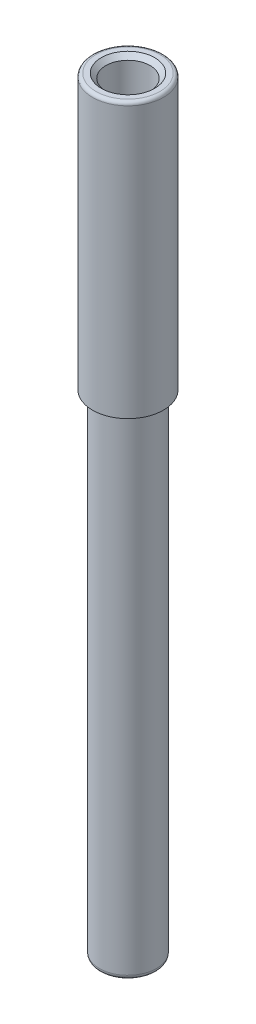
ISO-10303-21;
HEADER;
FILE_DESCRIPTION(('STEP AP214'),'2;1');
FILE_NAME('part.step','',(''),(''),'','','');
FILE_SCHEMA(('AUTOMOTIVE_DESIGN { 1 0 10303 214 1 1 1 1 }'));
ENDSEC;
DATA;
#1=APPLICATION_CONTEXT('core data for automotive mechanical design processes');
#2=APPLICATION_PROTOCOL_DEFINITION('international standard','automotive_design',2000,#1);
#3=PRODUCT_CONTEXT('',#1,'mechanical');
#4=PRODUCT('Part','Part','',(#3));
#5=PRODUCT_RELATED_PRODUCT_CATEGORY('part','',(#4));
#6=PRODUCT_DEFINITION_FORMATION('','',#4);
#7=PRODUCT_DEFINITION_CONTEXT('part definition',#1,'design');
#8=PRODUCT_DEFINITION('design','',#6,#7);
#9=PRODUCT_DEFINITION_SHAPE('','',#8);
#10=(LENGTH_UNIT() NAMED_UNIT(*) SI_UNIT(.MILLI.,.METRE.));
#11=(NAMED_UNIT(*) PLANE_ANGLE_UNIT() SI_UNIT($,.RADIAN.));
#12=(NAMED_UNIT(*) SI_UNIT($,.STERADIAN.) SOLID_ANGLE_UNIT());
#13=UNCERTAINTY_MEASURE_WITH_UNIT(LENGTH_MEASURE(1.E-05),#10,'distance_accuracy_value','');
#14=(GEOMETRIC_REPRESENTATION_CONTEXT(3) GLOBAL_UNCERTAINTY_ASSIGNED_CONTEXT((#13)) GLOBAL_UNIT_ASSIGNED_CONTEXT((#10,
#11,#12)) REPRESENTATION_CONTEXT('',''));
#15=CARTESIAN_POINT('',(0.,0.,0.));
#16=DIRECTION('',(0.,0.,1.));
#17=DIRECTION('',(1.,0.,0.));
#18=AXIS2_PLACEMENT_3D('',#15,#16,#17);
#19=CARTESIAN_POINT('',(0.,54.61,0.));
#20=DIRECTION('',(0.,1.,0.));
#21=DIRECTION('',(0.,0.,1.));
#22=AXIS2_PLACEMENT_3D('',#19,#20,#21);
#23=CYLINDRICAL_SURFACE('',#22,3.937);
#24=CARTESIAN_POINT('',(0.,84.709,0.));
#25=DIRECTION('',(0.,1.,0.));
#26=DIRECTION('',(0.,0.,1.));
#27=AXIS2_PLACEMENT_3D('',#24,#25,#26);
#28=CIRCLE('',#27,3.937);
#29=CARTESIAN_POINT('',(0.,84.709,3.937));
#30=VERTEX_POINT('',#29);
#31=EDGE_CURVE('E11',#30,#30,#28,.F.);
#32=ORIENTED_EDGE('',*,*,#31,.T.);
#33=EDGE_LOOP('',(#32));
#34=FACE_BOUND('',#33,.T.);
#35=CARTESIAN_POINT('',(0.,54.61,0.));
#36=DIRECTION('',(0.,1.,0.));
#37=DIRECTION('',(0.,0.,1.));
#38=AXIS2_PLACEMENT_3D('',#35,#36,#37);
#39=CIRCLE('',#38,3.937);
#40=CARTESIAN_POINT('',(0.,54.61,3.937));
#41=VERTEX_POINT('',#40);
#42=EDGE_CURVE('E70',#41,#41,#39,.T.);
#43=ORIENTED_EDGE('',*,*,#42,.T.);
#44=EDGE_LOOP('',(#43));
#45=FACE_BOUND('',#44,.T.);
#46=ADVANCED_FACE('F47',(#34,#45),#23,.T.);
#47=CARTESIAN_POINT('',(0.,54.61,0.));
#48=DIRECTION('',(0.,1.,0.));
#49=DIRECTION('',(0.,0.,1.));
#50=AXIS2_PLACEMENT_3D('',#47,#48,#49);
#51=PLANE('',#50);
#52=CARTESIAN_POINT('',(0.,54.61,0.));
#53=DIRECTION('',(0.,1.,0.));
#54=DIRECTION('',(0.,0.,1.));
#55=AXIS2_PLACEMENT_3D('',#52,#53,#54);
#56=CIRCLE('',#55,3.175);
#57=CARTESIAN_POINT('',(0.,54.61,3.175));
#58=VERTEX_POINT('',#57);
#59=EDGE_CURVE('E69',#58,#58,#56,.T.);
#60=ORIENTED_EDGE('',*,*,#59,.T.);
#61=EDGE_LOOP('',(#60));
#62=FACE_BOUND('',#61,.T.);
#63=ORIENTED_EDGE('',*,*,#42,.F.);
#64=EDGE_LOOP('',(#63));
#65=FACE_BOUND('',#64,.T.);
#66=ADVANCED_FACE('F105',(#62,#65),#51,.F.);
#67=CARTESIAN_POINT('',(0.,0.,0.));
#68=DIRECTION('',(0.,1.,0.));
#69=DIRECTION('',(0.,0.,1.));
#70=AXIS2_PLACEMENT_3D('',#67,#68,#69);
#71=PLANE('',#70);
#72=CARTESIAN_POINT('',(0.,0.,0.));
#73=DIRECTION('',(0.,1.,0.));
#74=DIRECTION('',(0.,0.,1.));
#75=AXIS2_PLACEMENT_3D('',#72,#73,#74);
#76=CIRCLE('',#75,2.667);
#77=CARTESIAN_POINT('',(0.,0.,2.667));
#78=VERTEX_POINT('',#77);
#79=EDGE_CURVE('E81',#78,#78,#76,.F.);
#80=ORIENTED_EDGE('',*,*,#79,.T.);
#81=EDGE_LOOP('',(#80));
#82=FACE_BOUND('',#81,.T.);
#83=ADVANCED_FACE('F111',(#82),#71,.F.);
#84=CARTESIAN_POINT('',(0.,57.15,0.));
#85=DIRECTION('',(0.,-1.,0.));
#86=DIRECTION('',(0.,0.,-1.));
#87=AXIS2_PLACEMENT_3D('',#84,#85,#86);
#88=CYLINDRICAL_SURFACE('',#87,3.175);
#89=CARTESIAN_POINT('',(0.,0.508000000000002,0.));
#90=DIRECTION('',(0.,1.,0.));
#91=DIRECTION('',(0.,0.,1.));
#92=AXIS2_PLACEMENT_3D('',#89,#90,#91);
#93=CIRCLE('',#92,3.175);
#94=CARTESIAN_POINT('',(0.,0.508000000000002,3.175));
#95=VERTEX_POINT('',#94);
#96=EDGE_CURVE('E74',#95,#95,#93,.T.);
#97=ORIENTED_EDGE('',*,*,#96,.T.);
#98=EDGE_LOOP('',(#97));
#99=FACE_BOUND('',#98,.T.);
#100=ORIENTED_EDGE('',*,*,#59,.F.);
#101=EDGE_LOOP('',(#100));
#102=FACE_BOUND('',#101,.T.);
#103=ADVANCED_FACE('F122',(#99,#102),#88,.T.);
#104=CARTESIAN_POINT('',(0.,0.508000000000002,0.));
#105=DIRECTION('',(0.,1.,0.));
#106=DIRECTION('',(0.,0.,1.));
#107=AXIS2_PLACEMENT_3D('',#104,#105,#106);
#108=TOROIDAL_SURFACE('',#107,2.667,0.508);
#109=ORIENTED_EDGE('',*,*,#79,.F.);
#110=EDGE_LOOP('',(#109));
#111=FACE_BOUND('',#110,.T.);
#112=ORIENTED_EDGE('',*,*,#96,.F.);
#113=EDGE_LOOP('',(#112));
#114=FACE_BOUND('',#113,.T.);
#115=ADVANCED_FACE('F126',(#111,#114),#108,.T.);
#116=CARTESIAN_POINT('',(0.,85.09,0.));
#117=DIRECTION('',(0.,1.,0.));
#118=DIRECTION('',(0.,0.,1.));
#119=AXIS2_PLACEMENT_3D('',#116,#117,#118);
#120=PLANE('',#119);
#121=CARTESIAN_POINT('',(0.,85.09,0.));
#122=DIRECTION('',(0.,1.,0.));
#123=DIRECTION('',(0.,0.,1.));
#124=AXIS2_PLACEMENT_3D('',#121,#122,#123);
#125=CIRCLE('',#124,3.556);
#126=CARTESIAN_POINT('',(0.,85.09,3.556));
#127=VERTEX_POINT('',#126);
#128=EDGE_CURVE('E54',#127,#127,#125,.T.);
#129=ORIENTED_EDGE('',*,*,#128,.T.);
#130=EDGE_LOOP('',(#129));
#131=FACE_BOUND('',#130,.T.);
#132=CARTESIAN_POINT('',(0.,85.09,0.));
#133=DIRECTION('',(0.,1.,0.));
#134=DIRECTION('',(0.,0.,1.));
#135=AXIS2_PLACEMENT_3D('',#132,#133,#134);
#136=CIRCLE('',#135,2.96544999999998);
#137=CARTESIAN_POINT('',(0.,85.09,2.96544999999998));
#138=VERTEX_POINT('',#137);
#139=EDGE_CURVE('E88',#138,#138,#136,.F.);
#140=ORIENTED_EDGE('',*,*,#139,.T.);
#141=EDGE_LOOP('',(#140));
#142=FACE_BOUND('',#141,.T.);
#143=ADVANCED_FACE('F62',(#131,#142),#120,.T.);
#144=CARTESIAN_POINT('',(0.,2.54,0.));
#145=DIRECTION('',(0.,1.,0.));
#146=DIRECTION('',(0.,0.,1.));
#147=AXIS2_PLACEMENT_3D('',#144,#145,#146);
#148=CONICAL_SURFACE('',#147,2.45744999999999,1.02974425867665);
#149=CARTESIAN_POINT('',(0.,1.06341507177072,0.));
#150=VERTEX_POINT('',#149);
#151=VERTEX_LOOP('',#150);
#152=FACE_BOUND('',#151,.T.);
#153=CARTESIAN_POINT('',(0.,2.54,0.));
#154=DIRECTION('',(0.,1.,0.));
#155=DIRECTION('',(0.,0.,1.));
#156=AXIS2_PLACEMENT_3D('',#153,#154,#155);
#157=CIRCLE('',#156,2.45744999999999);
#158=CARTESIAN_POINT('',(0.,2.54,2.45744999999999));
#159=VERTEX_POINT('',#158);
#160=EDGE_CURVE('E66',#159,#159,#157,.T.);
#161=ORIENTED_EDGE('',*,*,#160,.T.);
#162=EDGE_LOOP('',(#161));
#163=FACE_BOUND('',#162,.T.);
#164=ADVANCED_FACE('F58',(#152,#163),#148,.F.);
#165=CARTESIAN_POINT('',(0.,57.15,0.));
#166=DIRECTION('',(0.,1.,0.));
#167=DIRECTION('',(0.,0.,1.));
#168=AXIS2_PLACEMENT_3D('',#165,#166,#167);
#169=CYLINDRICAL_SURFACE('',#168,2.45744999999999);
#170=CARTESIAN_POINT('',(0.,84.582,0.));
#171=DIRECTION('',(0.,1.,0.));
#172=DIRECTION('',(0.,0.,1.));
#173=AXIS2_PLACEMENT_3D('',#170,#171,#172);
#174=CIRCLE('',#173,2.45744999999999);
#175=CARTESIAN_POINT('',(0.,84.582,2.45744999999999));
#176=VERTEX_POINT('',#175);
#177=EDGE_CURVE('E85',#176,#176,#174,.T.);
#178=ORIENTED_EDGE('',*,*,#177,.T.);
#179=EDGE_LOOP('',(#178));
#180=FACE_BOUND('',#179,.T.);
#181=ORIENTED_EDGE('',*,*,#160,.F.);
#182=EDGE_LOOP('',(#181));
#183=FACE_BOUND('',#182,.T.);
#184=ADVANCED_FACE('F61',(#180,#183),#169,.F.);
#185=CARTESIAN_POINT('',(0.,84.582,0.));
#186=DIRECTION('',(0.,1.,0.));
#187=DIRECTION('',(0.,0.,1.));
#188=AXIS2_PLACEMENT_3D('',#185,#186,#187);
#189=CONICAL_SURFACE('',#188,2.45744999999999,0.785398163397458);
#190=ORIENTED_EDGE('',*,*,#139,.F.);
#191=EDGE_LOOP('',(#190));
#192=FACE_BOUND('',#191,.T.);
#193=ORIENTED_EDGE('',*,*,#177,.F.);
#194=EDGE_LOOP('',(#193));
#195=FACE_BOUND('',#194,.T.);
#196=ADVANCED_FACE('F96',(#192,#195),#189,.F.);
#197=CARTESIAN_POINT('',(0.,84.709,0.));
#198=DIRECTION('',(0.,1.,0.));
#199=DIRECTION('',(0.,0.,1.));
#200=AXIS2_PLACEMENT_3D('',#197,#198,#199);
#201=TOROIDAL_SURFACE('',#200,3.556,0.381);
#202=ORIENTED_EDGE('',*,*,#31,.F.);
#203=EDGE_LOOP('',(#202));
#204=FACE_BOUND('',#203,.T.);
#205=ORIENTED_EDGE('',*,*,#128,.F.);
#206=EDGE_LOOP('',(#205));
#207=FACE_BOUND('',#206,.T.);
#208=ADVANCED_FACE('F49',(#204,#207),#201,.T.);
#209=CLOSED_SHELL('',(#46,#66,#83,#103,#115,#143,#164,#184,#196,#208));
#210=MANIFOLD_SOLID_BREP('B2',#209);
#211=ADVANCED_BREP_SHAPE_REPRESENTATION('',(#18,#210),#14);
#212=SHAPE_DEFINITION_REPRESENTATION(#9,#211);
ENDSEC;
END-ISO-10303-21;
